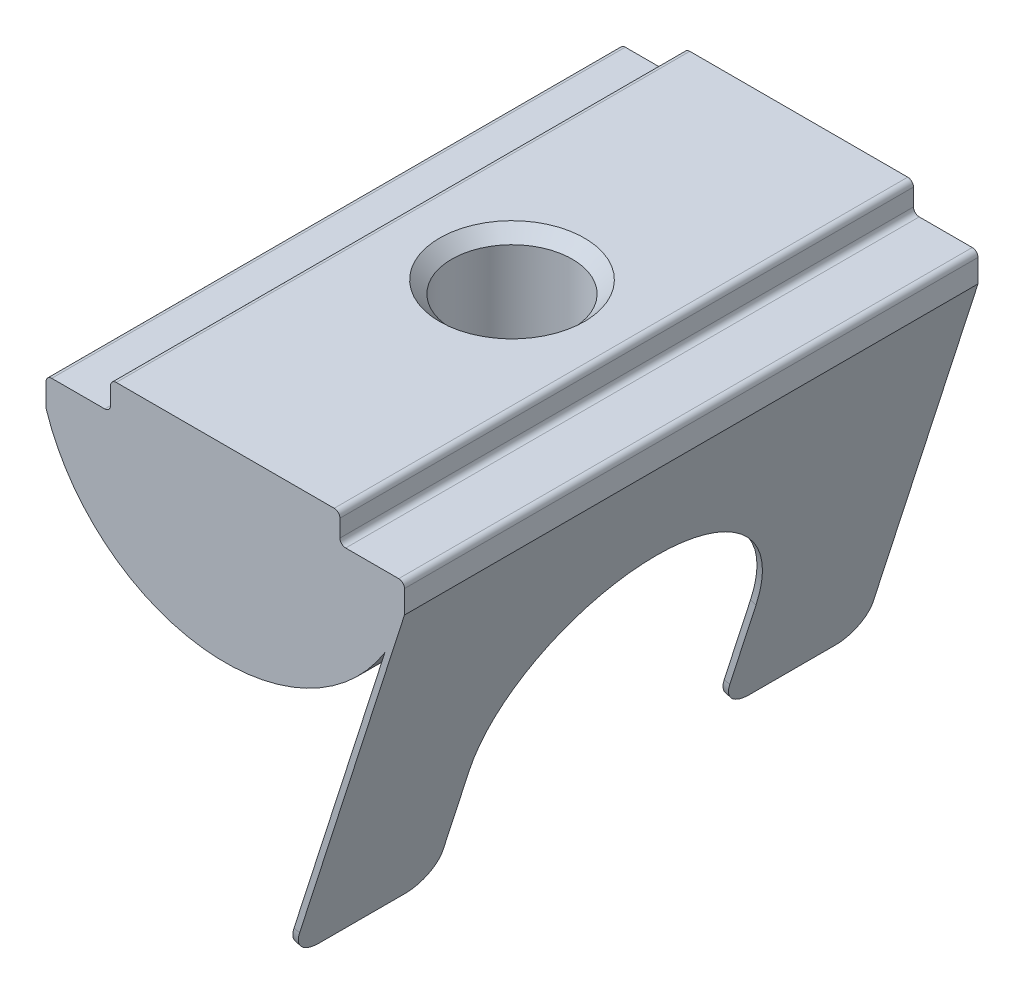
ISO-10303-21;
HEADER;
FILE_DESCRIPTION(('STEP AP214'),'2;1');
FILE_NAME('part.step','',(''),(''),'','','');
FILE_SCHEMA(('AUTOMOTIVE_DESIGN { 1 0 10303 214 1 1 1 1 }'));
ENDSEC;
DATA;
#1=APPLICATION_CONTEXT('core data for automotive mechanical design processes');
#2=APPLICATION_PROTOCOL_DEFINITION('international standard','automotive_design',2000,#1);
#3=PRODUCT_CONTEXT('',#1,'mechanical');
#4=PRODUCT('Part','Part','',(#3));
#5=PRODUCT_RELATED_PRODUCT_CATEGORY('part','',(#4));
#6=PRODUCT_DEFINITION_FORMATION('','',#4);
#7=PRODUCT_DEFINITION_CONTEXT('part definition',#1,'design');
#8=PRODUCT_DEFINITION('design','',#6,#7);
#9=PRODUCT_DEFINITION_SHAPE('','',#8);
#10=(LENGTH_UNIT() NAMED_UNIT(*) SI_UNIT(.MILLI.,.METRE.));
#11=(NAMED_UNIT(*) PLANE_ANGLE_UNIT() SI_UNIT($,.RADIAN.));
#12=(NAMED_UNIT(*) SI_UNIT($,.STERADIAN.) SOLID_ANGLE_UNIT());
#13=UNCERTAINTY_MEASURE_WITH_UNIT(LENGTH_MEASURE(1.E-05),#10,'distance_accuracy_value','');
#14=(GEOMETRIC_REPRESENTATION_CONTEXT(3) GLOBAL_UNCERTAINTY_ASSIGNED_CONTEXT((#13)) GLOBAL_UNIT_ASSIGNED_CONTEXT((#10,
#11,#12)) REPRESENTATION_CONTEXT('',''));
#15=CARTESIAN_POINT('',(0.,0.,0.));
#16=DIRECTION('',(0.,0.,1.));
#17=DIRECTION('',(1.,0.,0.));
#18=AXIS2_PLACEMENT_3D('',#15,#16,#17);
#19=CARTESIAN_POINT('',(2.09743071821094,-14.3205587681705,10.));
#20=DIRECTION('',(0.304775727103784,0.952424147199324,0.));
#21=DIRECTION('',(-0.952424147199324,0.304775727103784,0.));
#22=AXIS2_PLACEMENT_3D('',#19,#20,#21);
#23=PLANE('',#22);
#24=DIRECTION('',(0.,0.,-1.));
#25=VECTOR('',#24,1.);
#26=CARTESIAN_POINT('',(2.09743071821094,-14.3205587681705,10.));
#27=LINE('',#26,#25);
#28=CARTESIAN_POINT('',(2.09743071821094,-14.3205587681705,9.));
#29=VERTEX_POINT('',#28);
#30=CARTESIAN_POINT('',(2.09743071821094,-14.3205587681705,6.));
#31=VERTEX_POINT('',#30);
#32=EDGE_CURVE('E408',#29,#31,#27,.T.);
#33=ORIENTED_EDGE('',*,*,#32,.T.);
#34=DIRECTION('',(0.952424147199324,-0.304775727103784,0.));
#35=VECTOR('',#34,1.);
#36=CARTESIAN_POINT('',(2.09743071821094,-14.3205587681705,6.));
#37=LINE('',#36,#35);
#38=CARTESIAN_POINT('',(2.28791554765081,-14.3815139135912,6.));
#39=VERTEX_POINT('',#38);
#40=EDGE_CURVE('E364',#31,#39,#37,.T.);
#41=ORIENTED_EDGE('',*,*,#40,.T.);
#42=DIRECTION('',(0.,0.,-1.));
#43=VECTOR('',#42,1.);
#44=CARTESIAN_POINT('',(2.28791554765081,-14.3815139135912,10.));
#45=LINE('',#44,#43);
#46=CARTESIAN_POINT('',(2.28791554765081,-14.3815139135912,9.));
#47=VERTEX_POINT('',#46);
#48=EDGE_CURVE('E339',#47,#39,#45,.T.);
#49=ORIENTED_EDGE('',*,*,#48,.F.);
#50=DIRECTION('',(0.952424147199324,-0.304775727103784,0.));
#51=VECTOR('',#50,1.);
#52=CARTESIAN_POINT('',(2.09743071821094,-14.3205587681705,9.));
#53=LINE('',#52,#51);
#54=EDGE_CURVE('E362',#47,#29,#53,.F.);
#55=ORIENTED_EDGE('',*,*,#54,.T.);
#56=EDGE_LOOP('',(#33,#41,#49,#55));
#57=FACE_BOUND('',#56,.T.);
#58=ADVANCED_FACE('F37',(#57),#23,.F.);
#59=CARTESIAN_POINT('',(0.,0.,10.));
#60=DIRECTION('',(0.,0.,-1.));
#61=DIRECTION('',(-1.,0.,0.));
#62=AXIS2_PLACEMENT_3D('',#59,#60,#61);
#63=CYLINDRICAL_SURFACE('',#62,6.56220237420334);
#64=CARTESIAN_POINT('',(0.,-6.56220237420334,2.1));
#65=CARTESIAN_POINT('',(0.114837972898271,-6.56220209318466,2.09999968107459));
#66=CARTESIAN_POINT('',(0.229679907715986,-6.559159668174,2.0905492638789));
#67=CARTESIAN_POINT('',(0.455996684822379,-6.54732146200505,2.05310221910228));
#68=CARTESIAN_POINT('',(0.567470908819721,-6.53852463100784,2.02510220730504));
#69=CARTESIAN_POINT('',(0.783756369738062,-6.51613679070058,1.95160306994633));
#70=CARTESIAN_POINT('',(0.888577906794587,-6.5025534170512,1.90613180476144));
#71=CARTESIAN_POINT('',(1.08910806999092,-6.47198927944284,1.79910208523846));
#72=CARTESIAN_POINT('',(1.18481512390276,-6.45500793090185,1.73754086225176));
#73=CARTESIAN_POINT('',(1.36748363274895,-6.41883293542682,1.5979923591543));
#74=CARTESIAN_POINT('',(1.45411041189092,-6.39958936479068,1.5195799896454));
#75=CARTESIAN_POINT('',(1.61323560539941,-6.36134274912245,1.34945964265069));
#76=CARTESIAN_POINT('',(1.68573122484031,-6.3423397523657,1.25774904122205));
#77=CARTESIAN_POINT('',(1.81638455518048,-6.30618541130354,1.06069743562783));
#78=CARTESIAN_POINT('',(1.87411819163295,-6.28909541395882,0.955062922725573));
#79=CARTESIAN_POINT('',(1.9708605042522,-6.25945585062628,0.73494856654128));
#80=CARTESIAN_POINT('',(2.00987438699655,-6.24690502238607,0.620471193045037));
#81=CARTESIAN_POINT('',(2.06683414367046,-6.22828827837679,0.389708006852491));
#82=CARTESIAN_POINT('',(2.08540312035653,-6.2220311007487,0.273591865403767));
#83=CARTESIAN_POINT('',(2.10289310512259,-6.21614299045796,0.0397366080038057));
#84=CARTESIAN_POINT('',(2.10181963097214,-6.21651019693622,-0.0780020428814256));
#85=CARTESIAN_POINT('',(2.08054127152262,-6.22366096853996,-0.306550233554637));
#86=CARTESIAN_POINT('',(2.06113580162538,-6.23017641049133,-0.417444017446203));
#87=CARTESIAN_POINT('',(2.00504326158199,-6.24845283532842,-0.634310624484876));
#88=CARTESIAN_POINT('',(1.96835427307697,-6.26021440049221,-0.740282899941596));
#89=CARTESIAN_POINT('',(1.87818637351671,-6.28785816765236,-0.94617137388709));
#90=CARTESIAN_POINT('',(1.82446148993727,-6.30380010403038,-1.04597148433362));
#91=CARTESIAN_POINT('',(1.70191763500464,-6.33798182193432,-1.23539877738386));
#92=CARTESIAN_POINT('',(1.63309458422743,-6.35622222392232,-1.3250232006337));
#93=CARTESIAN_POINT('',(1.47841475218162,-6.39401394001684,-1.49606495477582));
#94=CARTESIAN_POINT('',(1.39190024886496,-6.41358620776773,-1.5768839895905));
#95=CARTESIAN_POINT('',(1.2063031519109,-6.45106843535328,-1.72301587074885));
#96=CARTESIAN_POINT('',(1.10721953538475,-6.46897825969075,-1.78832745383477));
#97=CARTESIAN_POINT('',(0.898102914882009,-6.50132175264522,-1.90202250078016));
#98=CARTESIAN_POINT('',(0.787983843891438,-6.51572451627568,-1.95025705304381));
#99=CARTESIAN_POINT('',(0.560625450045075,-6.53920761646083,-2.02733681502781));
#100=CARTESIAN_POINT('',(0.443388411968677,-6.54828965103952,-2.05618821099851));
#101=CARTESIAN_POINT('',(0.210195720792383,-6.55983189785325,-2.09264911263591));
#102=CARTESIAN_POINT('',(0.0943789242577967,-6.56254428644905,-2.10106802428145));
#103=CARTESIAN_POINT('',(-0.137028424222739,-6.5617911642366,-2.09871542507994));
#104=CARTESIAN_POINT('',(-0.252619008268713,-6.55832660492482,-2.08794686986862));
#105=CARTESIAN_POINT('',(-0.477129177611833,-6.54577488081022,-2.04817165516163));
#106=CARTESIAN_POINT('',(-0.586144253626822,-6.53683795064959,-2.01965198877257));
#107=CARTESIAN_POINT('',(-0.797807059643942,-6.51439489405104,-1.94578351867366));
#108=CARTESIAN_POINT('',(-0.900453990781565,-6.50088819571556,-1.90043260849766));
#109=CARTESIAN_POINT('',(-1.09933426769777,-6.47026647826994,-1.79292018579966));
#110=CARTESIAN_POINT('',(-1.19534199346514,-6.4530694071561,-1.7303653358489));
#111=CARTESIAN_POINT('',(-1.37576624761523,-6.41702781164892,-1.59068907754377));
#112=CARTESIAN_POINT('',(-1.46017947702196,-6.39818282085979,-1.5135635381653));
#113=CARTESIAN_POINT('',(-1.6186740570353,-6.35997820420135,-1.34312741143593));
#114=CARTESIAN_POINT('',(-1.6921781389746,-6.34062986575938,-1.24927622032743));
#115=CARTESIAN_POINT('',(-1.82245264394244,-6.30442333543144,-1.05015206944711));
#116=CARTESIAN_POINT('',(-1.87922320455711,-6.28756512307176,-0.944879203596157));
#117=CARTESIAN_POINT('',(-1.97409406049391,-6.25842810102044,-0.726032598276032));
#118=CARTESIAN_POINT('',(-2.01225572832212,-6.24613427036168,-0.612487584449459));
#119=CARTESIAN_POINT('',(-2.06876855501269,-6.22764786596621,-0.380105387986516));
#120=CARTESIAN_POINT('',(-2.08712773194925,-6.22145282290509,-0.261270367596047));
#121=CARTESIAN_POINT('',(-2.10292056714795,-6.21613118069138,-0.02774010056917));
#122=CARTESIAN_POINT('',(-2.10130508227452,-6.21668337636532,0.0868842899187375));
#123=CARTESIAN_POINT('',(-2.07950571781947,-6.22400876893457,0.314140714242524));
#124=CARTESIAN_POINT('',(-2.05932278527095,-6.23078164854373,0.426772849394802));
#125=CARTESIAN_POINT('',(-2.00161130676984,-6.2495554867399,0.645056165310856));
#126=CARTESIAN_POINT('',(-1.96436748873865,-6.26147044746646,0.750790587274424));
#127=CARTESIAN_POINT('',(-1.87381772625165,-6.28916038367176,0.9545933161729));
#128=CARTESIAN_POINT('',(-1.82050840343336,-6.30493617089981,1.05266000521716));
#129=CARTESIAN_POINT('',(-1.69680227954724,-6.3393720814804,1.24267135251031));
#130=CARTESIAN_POINT('',(-1.62579769197769,-6.35812354425033,1.33420369742646));
#131=CARTESIAN_POINT('',(-1.4697711032059,-6.39599162808321,1.50436175664481));
#132=CARTESIAN_POINT('',(-1.38474527902286,-6.41510834747541,1.58298393920731));
#133=CARTESIAN_POINT('',(-1.19952785842303,-6.45235223383863,1.72783895328859));
#134=CARTESIAN_POINT('',(-1.09891108213294,-6.47042171770385,1.79354468514162));
#135=CARTESIAN_POINT('',(-0.887484268081699,-6.5027904340613,1.90702736797981));
#136=CARTESIAN_POINT('',(-0.776677768697209,-6.51709096870059,1.95481051352097));
#137=CARTESIAN_POINT('',(-0.556075495231587,-6.53947189954991,2.02813317565881));
#138=CARTESIAN_POINT('',(-0.446758491661333,-6.54791953411465,2.05500262080888));
#139=CARTESIAN_POINT('',(-0.224961777297741,-6.55928428233315,2.09093417117999));
#140=CARTESIAN_POINT('',(-0.112482789187772,-6.56220264945869,2.10000031238464));
#141=CARTESIAN_POINT('',(0.,-6.56220237420334,2.1));
#142=B_SPLINE_CURVE_WITH_KNOTS('',3,(#64,#65,#66,#67,#68,#69,#70,#71,#72,#73,#74,#75,#76,#77,
#78,#79,#80,#81,#82,#83,#84,#85,#86,#87,#88,#89,#90,#91,#92,#93,#94,#95,#96,#97,#98,#99,#100,
#101,#102,#103,#104,#105,#106,#107,#108,#109,#110,#111,#112,#113,#114,#115,#116,#117,#118,#119,
#120,#121,#122,#123,#124,#125,#126,#127,#128,#129,#130,#131,#132,#133,#134,#135,#136,#137,#138,
#139,#140,#141),.UNSPECIFIED.,.T.,.F.,(4,2,2,2,2,2,2,2,2,2,2,2,2,2,2,2,2,2,2,2,2,2,2,2,2,2,2,2,
2,2,2,2,2,2,2,2,2,2,4),(0.,0.344100298309147,0.688263392095961,1.03187993189605,
1.37555563782444,1.72921148857121,2.08293721617852,2.44590436394302,2.80877050003487,
3.16024198833331,3.51161474613673,3.84833948455562,4.18510160605346,4.52696623529765,
4.8689233480996,5.22725086233284,5.58560755639724,5.94701631778454,6.30830967853666,
6.65503880919776,7.00171453435095,7.33927485484275,7.67687743598486,8.02295297867513,
8.3691267869789,8.729728948324,9.09032814464848,9.44972989591315,9.80898606988933,
10.1512090829284,10.4934146418425,10.8301062809461,11.1668687712966,11.5173542069483,
11.8679353632043,12.2307311801086,12.5934014886517,12.9305211520416,13.2675643820579),.UNSPECIFIED.);
#143=CARTESIAN_POINT('',(0.,-6.56220237420334,2.1));
#144=VERTEX_POINT('',#143);
#145=EDGE_CURVE('E273',#144,#144,#142,.T.);
#146=ORIENTED_EDGE('',*,*,#145,.T.);
#147=EDGE_LOOP('',(#146));
#148=FACE_BOUND('',#147,.T.);
#149=DIRECTION('',(0.,0.,-1.));
#150=VECTOR('',#149,1.);
#151=CARTESIAN_POINT('',(5.56951001555688,-3.47031096396441,10.));
#152=LINE('',#151,#150);
#153=CARTESIAN_POINT('',(5.56951001555688,-3.47031096396441,10.));
#154=VERTEX_POINT('',#153);
#155=CARTESIAN_POINT('',(5.56951001555688,-3.47031096396441,-10.));
#156=VERTEX_POINT('',#155);
#157=EDGE_CURVE('E410',#154,#156,#152,.T.);
#158=ORIENTED_EDGE('',*,*,#157,.F.);
#159=CARTESIAN_POINT('',(0.,0.,10.));
#160=DIRECTION('',(0.,0.,1.));
#161=DIRECTION('',(1.,0.,0.));
#162=AXIS2_PLACEMENT_3D('',#159,#160,#161);
#163=CIRCLE('',#162,6.56220237420334);
#164=CARTESIAN_POINT('',(-6.25,-2.,10.));
#165=VERTEX_POINT('',#164);
#166=EDGE_CURVE('E238',#165,#154,#163,.T.);
#167=ORIENTED_EDGE('',*,*,#166,.F.);
#168=DIRECTION('',(0.,0.,-1.));
#169=VECTOR('',#168,1.);
#170=CARTESIAN_POINT('',(-6.25,-2.,10.));
#171=LINE('',#170,#169);
#172=CARTESIAN_POINT('',(-6.25,-2.,-10.));
#173=VERTEX_POINT('',#172);
#174=EDGE_CURVE('E232',#165,#173,#171,.T.);
#175=ORIENTED_EDGE('',*,*,#174,.T.);
#176=CARTESIAN_POINT('',(0.,0.,-10.));
#177=DIRECTION('',(0.,0.,1.));
#178=DIRECTION('',(1.,0.,0.));
#179=AXIS2_PLACEMENT_3D('',#176,#177,#178);
#180=CIRCLE('',#179,6.56220237420334);
#181=EDGE_CURVE('E262',#173,#156,#180,.T.);
#182=ORIENTED_EDGE('',*,*,#181,.T.);
#183=EDGE_LOOP('',(#158,#167,#175,#182));
#184=FACE_BOUND('',#183,.T.);
#185=ADVANCED_FACE('F283',(#148,#184),#63,.T.);
#186=CARTESIAN_POINT('',(4.,-0.999999999999999,10.));
#187=DIRECTION('',(-1.,0.,0.));
#188=DIRECTION('',(0.,0.,1.));
#189=AXIS2_PLACEMENT_3D('',#186,#187,#188);
#190=PLANE('',#189);
#191=DIRECTION('',(0.,1.,0.));
#192=VECTOR('',#191,1.);
#193=CARTESIAN_POINT('',(4.,-0.999999999999999,10.));
#194=LINE('',#193,#192);
#195=CARTESIAN_POINT('',(4.,-0.799999999999998,10.));
#196=VERTEX_POINT('',#195);
#197=CARTESIAN_POINT('',(4.,-0.2,10.));
#198=VERTEX_POINT('',#197);
#199=EDGE_CURVE('E269',#196,#198,#194,.T.);
#200=ORIENTED_EDGE('',*,*,#199,.F.);
#201=DIRECTION('',(0.,0.,-1.));
#202=VECTOR('',#201,1.);
#203=CARTESIAN_POINT('',(4.,-0.799999999999998,-10.));
#204=LINE('',#203,#202);
#205=CARTESIAN_POINT('',(4.,-0.799999999999998,-10.));
#206=VERTEX_POINT('',#205);
#207=EDGE_CURVE('E488',#196,#206,#204,.T.);
#208=ORIENTED_EDGE('',*,*,#207,.T.);
#209=DIRECTION('',(0.,1.,0.));
#210=VECTOR('',#209,1.);
#211=CARTESIAN_POINT('',(4.,-0.999999999999999,-10.));
#212=LINE('',#211,#210);
#213=CARTESIAN_POINT('',(4.,-0.2,-10.));
#214=VERTEX_POINT('',#213);
#215=EDGE_CURVE('E247',#206,#214,#212,.T.);
#216=ORIENTED_EDGE('',*,*,#215,.T.);
#217=DIRECTION('',(0.,0.,-1.));
#218=VECTOR('',#217,1.);
#219=CARTESIAN_POINT('',(4.,-0.2,10.));
#220=LINE('',#219,#218);
#221=EDGE_CURVE('E491',#214,#198,#220,.F.);
#222=ORIENTED_EDGE('',*,*,#221,.T.);
#223=EDGE_LOOP('',(#200,#208,#216,#222));
#224=FACE_BOUND('',#223,.T.);
#225=ADVANCED_FACE('F318',(#224),#190,.F.);
#226=CARTESIAN_POINT('',(-4.,0.,10.));
#227=DIRECTION('',(0.,-1.,0.));
#228=DIRECTION('',(0.,0.,-1.));
#229=AXIS2_PLACEMENT_3D('',#226,#227,#228);
#230=PLANE('',#229);
#231=CARTESIAN_POINT('',(0.,0.,0.));
#232=DIRECTION('',(0.,1.,0.));
#233=DIRECTION('',(0.,0.,1.));
#234=AXIS2_PLACEMENT_3D('',#231,#232,#233);
#235=CIRCLE('',#234,2.525);
#236=CARTESIAN_POINT('',(0.,0.,2.525));
#237=VERTEX_POINT('',#236);
#238=EDGE_CURVE('E413',#237,#237,#235,.T.);
#239=ORIENTED_EDGE('',*,*,#238,.F.);
#240=EDGE_LOOP('',(#239));
#241=FACE_BOUND('',#240,.T.);
#242=DIRECTION('',(-1.,0.,0.));
#243=VECTOR('',#242,1.);
#244=CARTESIAN_POINT('',(-4.,0.,10.));
#245=LINE('',#244,#243);
#246=CARTESIAN_POINT('',(3.8,0.,10.));
#247=VERTEX_POINT('',#246);
#248=CARTESIAN_POINT('',(-3.8,0.,10.));
#249=VERTEX_POINT('',#248);
#250=EDGE_CURVE('E420',#247,#249,#245,.T.);
#251=ORIENTED_EDGE('',*,*,#250,.F.);
#252=DIRECTION('',(0.,0.,-1.));
#253=VECTOR('',#252,1.);
#254=CARTESIAN_POINT('',(3.8,0.,10.));
#255=LINE('',#254,#253);
#256=CARTESIAN_POINT('',(3.8,0.,-10.));
#257=VERTEX_POINT('',#256);
#258=EDGE_CURVE('E483',#247,#257,#255,.T.);
#259=ORIENTED_EDGE('',*,*,#258,.T.);
#260=DIRECTION('',(-1.,0.,0.));
#261=VECTOR('',#260,1.);
#262=CARTESIAN_POINT('',(-4.,0.,-10.));
#263=LINE('',#262,#261);
#264=CARTESIAN_POINT('',(-3.8,0.,-10.));
#265=VERTEX_POINT('',#264);
#266=EDGE_CURVE('E250',#257,#265,#263,.T.);
#267=ORIENTED_EDGE('',*,*,#266,.T.);
#268=DIRECTION('',(0.,0.,-1.));
#269=VECTOR('',#268,1.);
#270=CARTESIAN_POINT('',(-3.8,0.,10.));
#271=LINE('',#270,#269);
#272=EDGE_CURVE('E486',#265,#249,#271,.F.);
#273=ORIENTED_EDGE('',*,*,#272,.T.);
#274=EDGE_LOOP('',(#251,#259,#267,#273));
#275=FACE_BOUND('',#274,.T.);
#276=ADVANCED_FACE('F529',(#241,#275),#230,.F.);
#277=CARTESIAN_POINT('',(-4.,0.,10.));
#278=DIRECTION('',(1.,0.,0.));
#279=DIRECTION('',(0.,0.,-1.));
#280=AXIS2_PLACEMENT_3D('',#277,#278,#279);
#281=PLANE('',#280);
#282=DIRECTION('',(0.,-1.,0.));
#283=VECTOR('',#282,1.);
#284=CARTESIAN_POINT('',(-4.,0.,-10.));
#285=LINE('',#284,#283);
#286=CARTESIAN_POINT('',(-4.,-0.2,-10.));
#287=VERTEX_POINT('',#286);
#288=CARTESIAN_POINT('',(-4.,-0.8,-10.));
#289=VERTEX_POINT('',#288);
#290=EDGE_CURVE('E254',#287,#289,#285,.T.);
#291=ORIENTED_EDGE('',*,*,#290,.T.);
#292=DIRECTION('',(0.,0.,-1.));
#293=VECTOR('',#292,1.);
#294=CARTESIAN_POINT('',(-4.,-0.8,10.));
#295=LINE('',#294,#293);
#296=CARTESIAN_POINT('',(-4.,-0.8,10.));
#297=VERTEX_POINT('',#296);
#298=EDGE_CURVE('E471',#289,#297,#295,.F.);
#299=ORIENTED_EDGE('',*,*,#298,.T.);
#300=DIRECTION('',(0.,-1.,0.));
#301=VECTOR('',#300,1.);
#302=CARTESIAN_POINT('',(-4.,0.,10.));
#303=LINE('',#302,#301);
#304=CARTESIAN_POINT('',(-4.,-0.2,10.));
#305=VERTEX_POINT('',#304);
#306=EDGE_CURVE('E423',#305,#297,#303,.T.);
#307=ORIENTED_EDGE('',*,*,#306,.F.);
#308=DIRECTION('',(0.,0.,-1.));
#309=VECTOR('',#308,1.);
#310=CARTESIAN_POINT('',(-4.,-0.2,10.));
#311=LINE('',#310,#309);
#312=EDGE_CURVE('E473',#305,#287,#311,.T.);
#313=ORIENTED_EDGE('',*,*,#312,.T.);
#314=EDGE_LOOP('',(#291,#299,#307,#313));
#315=FACE_BOUND('',#314,.T.);
#316=ADVANCED_FACE('F538',(#315),#281,.F.);
#317=CARTESIAN_POINT('',(-4.,-1.,10.));
#318=DIRECTION('',(0.,-1.,0.));
#319=DIRECTION('',(1.,0.,0.));
#320=AXIS2_PLACEMENT_3D('',#317,#318,#319);
#321=PLANE('',#320);
#322=DIRECTION('',(-1.,0.,0.));
#323=VECTOR('',#322,1.);
#324=CARTESIAN_POINT('',(-4.,-1.,-10.));
#325=LINE('',#324,#323);
#326=CARTESIAN_POINT('',(-4.2,-1.,-10.));
#327=VERTEX_POINT('',#326);
#328=CARTESIAN_POINT('',(-6.05,-1.,-10.));
#329=VERTEX_POINT('',#328);
#330=EDGE_CURVE('E257',#327,#329,#325,.T.);
#331=ORIENTED_EDGE('',*,*,#330,.T.);
#332=DIRECTION('',(0.,0.,-1.));
#333=VECTOR('',#332,1.);
#334=CARTESIAN_POINT('',(-6.05,-1.,10.));
#335=LINE('',#334,#333);
#336=CARTESIAN_POINT('',(-6.05,-1.,10.));
#337=VERTEX_POINT('',#336);
#338=EDGE_CURVE('E476',#329,#337,#335,.F.);
#339=ORIENTED_EDGE('',*,*,#338,.T.);
#340=DIRECTION('',(-1.,0.,0.));
#341=VECTOR('',#340,1.);
#342=CARTESIAN_POINT('',(-4.,-1.,10.));
#343=LINE('',#342,#341);
#344=CARTESIAN_POINT('',(-4.2,-1.,10.));
#345=VERTEX_POINT('',#344);
#346=EDGE_CURVE('E426',#345,#337,#343,.T.);
#347=ORIENTED_EDGE('',*,*,#346,.F.);
#348=DIRECTION('',(0.,0.,-1.));
#349=VECTOR('',#348,1.);
#350=CARTESIAN_POINT('',(-4.2,-1.,-10.));
#351=LINE('',#350,#349);
#352=EDGE_CURVE('E478',#345,#327,#351,.T.);
#353=ORIENTED_EDGE('',*,*,#352,.T.);
#354=EDGE_LOOP('',(#331,#339,#347,#353));
#355=FACE_BOUND('',#354,.T.);
#356=ADVANCED_FACE('F309',(#355),#321,.F.);
#357=CARTESIAN_POINT('',(-6.25,-1.,10.));
#358=DIRECTION('',(1.,0.,0.));
#359=DIRECTION('',(0.,1.,0.));
#360=AXIS2_PLACEMENT_3D('',#357,#358,#359);
#361=PLANE('',#360);
#362=DIRECTION('',(0.,-1.,0.));
#363=VECTOR('',#362,1.);
#364=CARTESIAN_POINT('',(-6.25,-1.,10.));
#365=LINE('',#364,#363);
#366=CARTESIAN_POINT('',(-6.25,-1.2,10.));
#367=VERTEX_POINT('',#366);
#368=EDGE_CURVE('E243',#367,#165,#365,.T.);
#369=ORIENTED_EDGE('',*,*,#368,.F.);
#370=DIRECTION('',(0.,0.,-1.));
#371=VECTOR('',#370,1.);
#372=CARTESIAN_POINT('',(-6.25,-1.2,10.));
#373=LINE('',#372,#371);
#374=CARTESIAN_POINT('',(-6.25,-1.2,-10.));
#375=VERTEX_POINT('',#374);
#376=EDGE_CURVE('E481',#367,#375,#373,.T.);
#377=ORIENTED_EDGE('',*,*,#376,.T.);
#378=DIRECTION('',(0.,-1.,0.));
#379=VECTOR('',#378,1.);
#380=CARTESIAN_POINT('',(-6.25,-1.,-10.));
#381=LINE('',#380,#379);
#382=EDGE_CURVE('E260',#375,#173,#381,.T.);
#383=ORIENTED_EDGE('',*,*,#382,.T.);
#384=ORIENTED_EDGE('',*,*,#174,.F.);
#385=EDGE_LOOP('',(#369,#377,#383,#384));
#386=FACE_BOUND('',#385,.T.);
#387=ADVANCED_FACE('F305',(#386),#361,.F.);
#388=CARTESIAN_POINT('',(6.25,-0.999999999999999,10.));
#389=DIRECTION('',(-1.,0.,0.));
#390=DIRECTION('',(0.,0.,1.));
#391=AXIS2_PLACEMENT_3D('',#388,#389,#390);
#392=PLANE('',#391);
#393=DIRECTION('',(0.,1.,0.));
#394=VECTOR('',#393,1.);
#395=CARTESIAN_POINT('',(6.25,-0.999999999999999,-10.));
#396=LINE('',#395,#394);
#397=CARTESIAN_POINT('',(6.25,-2.,-10.));
#398=VERTEX_POINT('',#397);
#399=CARTESIAN_POINT('',(6.25,-1.2,-10.));
#400=VERTEX_POINT('',#399);
#401=EDGE_CURVE('E265',#398,#400,#396,.T.);
#402=ORIENTED_EDGE('',*,*,#401,.T.);
#403=DIRECTION('',(0.,0.,-1.));
#404=VECTOR('',#403,1.);
#405=CARTESIAN_POINT('',(6.25,-1.2,10.));
#406=LINE('',#405,#404);
#407=CARTESIAN_POINT('',(6.25,-1.2,10.));
#408=VERTEX_POINT('',#407);
#409=EDGE_CURVE('E237',#400,#408,#406,.F.);
#410=ORIENTED_EDGE('',*,*,#409,.T.);
#411=DIRECTION('',(0.,1.,0.));
#412=VECTOR('',#411,1.);
#413=CARTESIAN_POINT('',(6.25,-0.999999999999999,10.));
#414=LINE('',#413,#412);
#415=CARTESIAN_POINT('',(6.25,-2.,10.));
#416=VERTEX_POINT('',#415);
#417=EDGE_CURVE('E216',#416,#408,#414,.T.);
#418=ORIENTED_EDGE('',*,*,#417,.F.);
#419=DIRECTION('',(0.,0.,-1.));
#420=VECTOR('',#419,1.);
#421=CARTESIAN_POINT('',(6.25,-2.,10.));
#422=LINE('',#421,#420);
#423=EDGE_CURVE('E224',#416,#398,#422,.T.);
#424=ORIENTED_EDGE('',*,*,#423,.T.);
#425=EDGE_LOOP('',(#402,#410,#418,#424));
#426=FACE_BOUND('',#425,.T.);
#427=ADVANCED_FACE('F235',(#426),#392,.F.);
#428=CARTESIAN_POINT('',(4.,-0.999999999999999,10.));
#429=DIRECTION('',(0.,-1.,0.));
#430=DIRECTION('',(1.,0.,0.));
#431=AXIS2_PLACEMENT_3D('',#428,#429,#430);
#432=PLANE('',#431);
#433=DIRECTION('',(-1.,0.,0.));
#434=VECTOR('',#433,1.);
#435=CARTESIAN_POINT('',(4.,-0.999999999999999,10.));
#436=LINE('',#435,#434);
#437=CARTESIAN_POINT('',(6.05,-0.999999999999999,10.));
#438=VERTEX_POINT('',#437);
#439=CARTESIAN_POINT('',(4.2,-0.999999999999999,10.));
#440=VERTEX_POINT('',#439);
#441=EDGE_CURVE('E233',#438,#440,#436,.T.);
#442=ORIENTED_EDGE('',*,*,#441,.F.);
#443=DIRECTION('',(0.,0.,-1.));
#444=VECTOR('',#443,1.);
#445=CARTESIAN_POINT('',(6.05,-0.999999999999999,10.));
#446=LINE('',#445,#444);
#447=CARTESIAN_POINT('',(6.05,-0.999999999999999,-10.));
#448=VERTEX_POINT('',#447);
#449=EDGE_CURVE('E508',#438,#448,#446,.T.);
#450=ORIENTED_EDGE('',*,*,#449,.T.);
#451=DIRECTION('',(-1.,0.,0.));
#452=VECTOR('',#451,1.);
#453=CARTESIAN_POINT('',(4.,-0.999999999999999,-10.));
#454=LINE('',#453,#452);
#455=CARTESIAN_POINT('',(4.2,-0.999999999999999,-10.));
#456=VERTEX_POINT('',#455);
#457=EDGE_CURVE('E267',#448,#456,#454,.T.);
#458=ORIENTED_EDGE('',*,*,#457,.T.);
#459=DIRECTION('',(0.,0.,-1.));
#460=VECTOR('',#459,1.);
#461=CARTESIAN_POINT('',(4.2,-0.999999999999999,10.));
#462=LINE('',#461,#460);
#463=EDGE_CURVE('E281',#456,#440,#462,.F.);
#464=ORIENTED_EDGE('',*,*,#463,.T.);
#465=EDGE_LOOP('',(#442,#450,#458,#464));
#466=FACE_BOUND('',#465,.T.);
#467=ADVANCED_FACE('F298',(#466),#432,.F.);
#468=CARTESIAN_POINT('',(0.,0.,10.));
#469=DIRECTION('',(0.,0.,1.));
#470=DIRECTION('',(1.,0.,0.));
#471=AXIS2_PLACEMENT_3D('',#468,#469,#470);
#472=PLANE('',#471);
#473=DIRECTION('',(-0.304775727103784,-0.952424147199324,0.));
#474=VECTOR('',#473,1.);
#475=CARTESIAN_POINT('',(6.05951517056013,-1.93904485457925,10.));
#476=LINE('',#475,#474);
#477=CARTESIAN_POINT('',(2.40220644531473,-13.3681346209711,10.));
#478=VERTEX_POINT('',#477);
#479=EDGE_CURVE('E221',#154,#478,#476,.T.);
#480=ORIENTED_EDGE('',*,*,#479,.T.);
#481=DIRECTION('',(0.952424147199324,-0.304775727103784,0.));
#482=VECTOR('',#481,1.);
#483=CARTESIAN_POINT('',(2.59269127475459,-13.4290897663919,10.));
#484=LINE('',#483,#482);
#485=CARTESIAN_POINT('',(2.59269127475459,-13.4290897663919,10.));
#486=VERTEX_POINT('',#485);
#487=EDGE_CURVE('E219',#478,#486,#484,.T.);
#488=ORIENTED_EDGE('',*,*,#487,.T.);
#489=DIRECTION('',(0.304775727103784,0.952424147199324,0.));
#490=VECTOR('',#489,1.);
#491=CARTESIAN_POINT('',(6.25,-2.,10.));
#492=LINE('',#491,#490);
#493=EDGE_CURVE('E211',#486,#416,#492,.T.);
#494=ORIENTED_EDGE('',*,*,#493,.T.);
#495=ORIENTED_EDGE('',*,*,#417,.T.);
#496=CARTESIAN_POINT('',(6.05,-1.2,10.));
#497=DIRECTION('',(0.,0.,1.));
#498=DIRECTION('',(1.,0.,0.));
#499=AXIS2_PLACEMENT_3D('',#496,#497,#498);
#500=CIRCLE('',#499,0.2);
#501=EDGE_CURVE('E493',#408,#438,#500,.T.);
#502=ORIENTED_EDGE('',*,*,#501,.T.);
#503=ORIENTED_EDGE('',*,*,#441,.T.);
#504=CARTESIAN_POINT('',(4.2,-0.799999999999998,10.));
#505=DIRECTION('',(0.,0.,1.));
#506=DIRECTION('',(1.,0.,0.));
#507=AXIS2_PLACEMENT_3D('',#504,#505,#506);
#508=CIRCLE('',#507,0.2);
#509=EDGE_CURVE('E467',#440,#196,#508,.F.);
#510=ORIENTED_EDGE('',*,*,#509,.T.);
#511=ORIENTED_EDGE('',*,*,#199,.T.);
#512=CARTESIAN_POINT('',(3.8,-0.2,10.));
#513=DIRECTION('',(0.,0.,1.));
#514=DIRECTION('',(1.,0.,0.));
#515=AXIS2_PLACEMENT_3D('',#512,#513,#514);
#516=CIRCLE('',#515,0.2);
#517=EDGE_CURVE('E495',#198,#247,#516,.T.);
#518=ORIENTED_EDGE('',*,*,#517,.T.);
#519=ORIENTED_EDGE('',*,*,#250,.T.);
#520=CARTESIAN_POINT('',(-3.8,-0.2,10.));
#521=DIRECTION('',(0.,0.,1.));
#522=DIRECTION('',(1.,0.,0.));
#523=AXIS2_PLACEMENT_3D('',#520,#521,#522);
#524=CIRCLE('',#523,0.2);
#525=EDGE_CURVE('E498',#249,#305,#524,.T.);
#526=ORIENTED_EDGE('',*,*,#525,.T.);
#527=ORIENTED_EDGE('',*,*,#306,.T.);
#528=CARTESIAN_POINT('',(-4.2,-0.8,10.));
#529=DIRECTION('',(0.,0.,1.));
#530=DIRECTION('',(1.,0.,0.));
#531=AXIS2_PLACEMENT_3D('',#528,#529,#530);
#532=CIRCLE('',#531,0.2);
#533=EDGE_CURVE('E463',#297,#345,#532,.F.);
#534=ORIENTED_EDGE('',*,*,#533,.T.);
#535=ORIENTED_EDGE('',*,*,#346,.T.);
#536=CARTESIAN_POINT('',(-6.05,-1.2,10.));
#537=DIRECTION('',(0.,0.,1.));
#538=DIRECTION('',(1.,0.,0.));
#539=AXIS2_PLACEMENT_3D('',#536,#537,#538);
#540=CIRCLE('',#539,0.2);
#541=EDGE_CURVE('E432',#337,#367,#540,.T.);
#542=ORIENTED_EDGE('',*,*,#541,.T.);
#543=ORIENTED_EDGE('',*,*,#368,.T.);
#544=ORIENTED_EDGE('',*,*,#166,.T.);
#545=EDGE_LOOP('',(#480,#488,#494,#495,#502,#503,#510,#511,#518,#519,#526,#527,#534,#535,#542,
#543,#544));
#546=FACE_BOUND('',#545,.T.);
#547=ADVANCED_FACE('F214',(#546),#472,.T.);
#548=CARTESIAN_POINT('',(0.,0.,-10.));
#549=DIRECTION('',(0.,0.,1.));
#550=DIRECTION('',(1.,0.,0.));
#551=AXIS2_PLACEMENT_3D('',#548,#549,#550);
#552=PLANE('',#551);
#553=DIRECTION('',(0.304775727103784,0.952424147199324,0.));
#554=VECTOR('',#553,1.);
#555=CARTESIAN_POINT('',(6.25,-2.,-10.));
#556=LINE('',#555,#554);
#557=CARTESIAN_POINT('',(2.59269127475459,-13.4290897663919,-10.));
#558=VERTEX_POINT('',#557);
#559=EDGE_CURVE('E228',#558,#398,#556,.T.);
#560=ORIENTED_EDGE('',*,*,#559,.F.);
#561=DIRECTION('',(0.952424147199324,-0.304775727103784,0.));
#562=VECTOR('',#561,1.);
#563=CARTESIAN_POINT('',(-3.65730872524541,-11.4290897663919,-10.));
#564=LINE('',#563,#562);
#565=CARTESIAN_POINT('',(2.40220644531473,-13.3681346209711,-10.));
#566=VERTEX_POINT('',#565);
#567=EDGE_CURVE('E360',#558,#566,#564,.F.);
#568=ORIENTED_EDGE('',*,*,#567,.T.);
#569=DIRECTION('',(-0.304775727103784,-0.952424147199324,0.));
#570=VECTOR('',#569,1.);
#571=CARTESIAN_POINT('',(6.05951517056013,-1.93904485457925,-10.));
#572=LINE('',#571,#570);
#573=EDGE_CURVE('E386',#156,#566,#572,.T.);
#574=ORIENTED_EDGE('',*,*,#573,.F.);
#575=ORIENTED_EDGE('',*,*,#181,.F.);
#576=ORIENTED_EDGE('',*,*,#382,.F.);
#577=CARTESIAN_POINT('',(-6.05,-1.2,-10.));
#578=DIRECTION('',(0.,0.,1.));
#579=DIRECTION('',(1.,0.,0.));
#580=AXIS2_PLACEMENT_3D('',#577,#578,#579);
#581=CIRCLE('',#580,0.2);
#582=EDGE_CURVE('E505',#375,#329,#581,.F.);
#583=ORIENTED_EDGE('',*,*,#582,.T.);
#584=ORIENTED_EDGE('',*,*,#330,.F.);
#585=CARTESIAN_POINT('',(-4.2,-0.8,-10.));
#586=DIRECTION('',(0.,0.,1.));
#587=DIRECTION('',(1.,0.,0.));
#588=AXIS2_PLACEMENT_3D('',#585,#586,#587);
#589=CIRCLE('',#588,0.2);
#590=EDGE_CURVE('E465',#327,#289,#589,.T.);
#591=ORIENTED_EDGE('',*,*,#590,.T.);
#592=ORIENTED_EDGE('',*,*,#290,.F.);
#593=CARTESIAN_POINT('',(-3.8,-0.2,-10.));
#594=DIRECTION('',(0.,0.,1.));
#595=DIRECTION('',(1.,0.,0.));
#596=AXIS2_PLACEMENT_3D('',#593,#594,#595);
#597=CIRCLE('',#596,0.2);
#598=EDGE_CURVE('E507',#287,#265,#597,.F.);
#599=ORIENTED_EDGE('',*,*,#598,.T.);
#600=ORIENTED_EDGE('',*,*,#266,.F.);
#601=CARTESIAN_POINT('',(3.8,-0.2,-10.));
#602=DIRECTION('',(0.,0.,1.));
#603=DIRECTION('',(1.,0.,0.));
#604=AXIS2_PLACEMENT_3D('',#601,#602,#603);
#605=CIRCLE('',#604,0.2);
#606=EDGE_CURVE('E503',#257,#214,#605,.F.);
#607=ORIENTED_EDGE('',*,*,#606,.T.);
#608=ORIENTED_EDGE('',*,*,#215,.F.);
#609=CARTESIAN_POINT('',(4.2,-0.799999999999998,-10.));
#610=DIRECTION('',(0.,0.,1.));
#611=DIRECTION('',(1.,0.,0.));
#612=AXIS2_PLACEMENT_3D('',#609,#610,#611);
#613=CIRCLE('',#612,0.2);
#614=EDGE_CURVE('E469',#206,#456,#613,.T.);
#615=ORIENTED_EDGE('',*,*,#614,.T.);
#616=ORIENTED_EDGE('',*,*,#457,.F.);
#617=CARTESIAN_POINT('',(6.05,-1.2,-10.));
#618=DIRECTION('',(0.,0.,1.));
#619=DIRECTION('',(1.,0.,0.));
#620=AXIS2_PLACEMENT_3D('',#617,#618,#619);
#621=CIRCLE('',#620,0.2);
#622=EDGE_CURVE('E501',#448,#400,#621,.F.);
#623=ORIENTED_EDGE('',*,*,#622,.T.);
#624=ORIENTED_EDGE('',*,*,#401,.F.);
#625=EDGE_LOOP('',(#560,#568,#574,#575,#576,#583,#584,#591,#592,#599,#600,#607,#608,#615,#616,
#623,#624));
#626=FACE_BOUND('',#625,.T.);
#627=ADVANCED_FACE('F293',(#626),#552,.F.);
#628=CARTESIAN_POINT('',(0.,0.,0.));
#629=DIRECTION('',(0.,1.,0.));
#630=DIRECTION('',(0.,0.,1.));
#631=AXIS2_PLACEMENT_3D('',#628,#629,#630);
#632=CYLINDRICAL_SURFACE('',#631,2.1);
#633=CARTESIAN_POINT('',(0.,-0.424999999999998,0.));
#634=DIRECTION('',(0.,1.,0.));
#635=DIRECTION('',(0.,0.,1.));
#636=AXIS2_PLACEMENT_3D('',#633,#634,#635);
#637=CIRCLE('',#636,2.1);
#638=CARTESIAN_POINT('',(0.,-0.424999999999998,2.1));
#639=VERTEX_POINT('',#638);
#640=EDGE_CURVE('E251',#639,#639,#637,.T.);
#641=ORIENTED_EDGE('',*,*,#640,.T.);
#642=EDGE_LOOP('',(#641));
#643=FACE_BOUND('',#642,.T.);
#644=ORIENTED_EDGE('',*,*,#145,.F.);
#645=EDGE_LOOP('',(#644));
#646=FACE_BOUND('',#645,.T.);
#647=ADVANCED_FACE('F287',(#643,#646),#632,.F.);
#648=CARTESIAN_POINT('',(0.,0.,0.));
#649=DIRECTION('',(0.,1.,0.));
#650=DIRECTION('',(0.,0.,1.));
#651=AXIS2_PLACEMENT_3D('',#648,#649,#650);
#652=CONICAL_SURFACE('',#651,2.525,0.78539816339745);
#653=ORIENTED_EDGE('',*,*,#640,.F.);
#654=EDGE_LOOP('',(#653));
#655=FACE_BOUND('',#654,.T.);
#656=ORIENTED_EDGE('',*,*,#238,.T.);
#657=EDGE_LOOP('',(#656));
#658=FACE_BOUND('',#657,.T.);
#659=ADVANCED_FACE('F292',(#655,#658),#652,.F.);
#660=CARTESIAN_POINT('',(6.05951517056013,-1.93904485457925,10.));
#661=DIRECTION('',(0.952424147199324,-0.304775727103784,0.));
#662=DIRECTION('',(0.304775727103784,0.952424147199324,0.));
#663=AXIS2_PLACEMENT_3D('',#660,#661,#662);
#664=PLANE('',#663);
#665=CARTESIAN_POINT('',(2.09743071821094,-14.3205587681705,-6.));
#666=VERTEX_POINT('',#665);
#667=CARTESIAN_POINT('',(2.09743071821094,-14.3205587681705,-9.));
#668=VERTEX_POINT('',#667);
#669=EDGE_CURVE('E411',#666,#668,#27,.T.);
#670=ORIENTED_EDGE('',*,*,#669,.F.);
#671=CARTESIAN_POINT('',(2.40220644531473,-13.3681346209711,-6.));
#672=DIRECTION('',(0.952424147199324,-0.304775727103784,0.));
#673=DIRECTION('',(0.304775727103784,0.952424147199324,0.));
#674=AXIS2_PLACEMENT_3D('',#671,#672,#673);
#675=CIRCLE('',#674,1.);
#676=CARTESIAN_POINT('',(2.40220644531473,-13.3681346209711,-5.));
#677=VERTEX_POINT('',#676);
#678=EDGE_CURVE('E348',#666,#677,#675,.F.);
#679=ORIENTED_EDGE('',*,*,#678,.T.);
#680=DIRECTION('',(-0.304775727103784,-0.952424147199324,0.));
#681=VECTOR('',#680,1.);
#682=CARTESIAN_POINT('',(2.09743071821094,-14.3205587681705,-5.));
#683=LINE('',#682,#681);
#684=CARTESIAN_POINT('',(3.31653362662608,-10.5108621793732,-5.));
#685=VERTEX_POINT('',#684);
#686=EDGE_CURVE('E391',#685,#677,#683,.T.);
#687=ORIENTED_EDGE('',*,*,#686,.F.);
#688=CARTESIAN_POINT('',(3.31653362662607,-10.5108621793732,0.));
#689=DIRECTION('',(0.952424147199324,-0.304775727103784,0.));
#690=DIRECTION('',(0.304775727103784,0.952424147199324,0.));
#691=AXIS2_PLACEMENT_3D('',#688,#689,#690);
#692=CIRCLE('',#691,5.);
#693=CARTESIAN_POINT('',(4.840412262145,-5.74874144337654,0.));
#694=VERTEX_POINT('',#693);
#695=EDGE_CURVE('E11',#685,#694,#692,.T.);
#696=ORIENTED_EDGE('',*,*,#695,.T.);
#697=CARTESIAN_POINT('',(3.31653362662608,-10.5108621793732,0.));
#698=DIRECTION('',(0.952424147199324,-0.304775727103784,0.));
#699=DIRECTION('',(0.304775727103784,0.952424147199324,0.));
#700=AXIS2_PLACEMENT_3D('',#697,#698,#699);
#701=CIRCLE('',#700,5.);
#702=CARTESIAN_POINT('',(3.31653362662608,-10.5108621793732,5.));
#703=VERTEX_POINT('',#702);
#704=EDGE_CURVE('E376',#694,#703,#701,.T.);
#705=ORIENTED_EDGE('',*,*,#704,.T.);
#706=DIRECTION('',(0.304775727103784,0.952424147199324,0.));
#707=VECTOR('',#706,1.);
#708=CARTESIAN_POINT('',(2.09743071821094,-14.3205587681705,5.));
#709=LINE('',#708,#707);
#710=CARTESIAN_POINT('',(2.40220644531473,-13.3681346209711,5.));
#711=VERTEX_POINT('',#710);
#712=EDGE_CURVE('E396',#711,#703,#709,.T.);
#713=ORIENTED_EDGE('',*,*,#712,.F.);
#714=CARTESIAN_POINT('',(2.40220644531473,-13.3681346209711,6.));
#715=DIRECTION('',(0.952424147199324,-0.304775727103784,0.));
#716=DIRECTION('',(0.304775727103784,0.952424147199324,0.));
#717=AXIS2_PLACEMENT_3D('',#714,#715,#716);
#718=CIRCLE('',#717,1.);
#719=EDGE_CURVE('E351',#711,#31,#718,.F.);
#720=ORIENTED_EDGE('',*,*,#719,.T.);
#721=ORIENTED_EDGE('',*,*,#32,.F.);
#722=CARTESIAN_POINT('',(2.40220644531472,-13.3681346209711,9.));
#723=DIRECTION('',(0.952424147199324,-0.304775727103784,0.));
#724=DIRECTION('',(0.304775727103784,0.952424147199324,0.));
#725=AXIS2_PLACEMENT_3D('',#722,#723,#724);
#726=CIRCLE('',#725,1.);
#727=EDGE_CURVE('E349',#29,#478,#726,.F.);
#728=ORIENTED_EDGE('',*,*,#727,.T.);
#729=ORIENTED_EDGE('',*,*,#479,.F.);
#730=ORIENTED_EDGE('',*,*,#157,.T.);
#731=ORIENTED_EDGE('',*,*,#573,.T.);
#732=CARTESIAN_POINT('',(2.40220644531473,-13.3681346209711,-9.));
#733=DIRECTION('',(0.952424147199324,-0.304775727103784,0.));
#734=DIRECTION('',(0.304775727103784,0.952424147199324,0.));
#735=AXIS2_PLACEMENT_3D('',#732,#733,#734);
#736=CIRCLE('',#735,1.);
#737=EDGE_CURVE('E357',#566,#668,#736,.F.);
#738=ORIENTED_EDGE('',*,*,#737,.T.);
#739=EDGE_LOOP('',(#670,#679,#687,#696,#705,#713,#720,#721,#728,#729,#730,#731,#738));
#740=FACE_BOUND('',#739,.T.);
#741=ADVANCED_FACE('F323',(#740),#664,.F.);
#742=CARTESIAN_POINT('',(2.28791554765081,-14.3815139135912,-6.));
#743=VERTEX_POINT('',#742);
#744=CARTESIAN_POINT('',(2.28791554765081,-14.3815139135912,-9.));
#745=VERTEX_POINT('',#744);
#746=EDGE_CURVE('E220',#743,#745,#45,.T.);
#747=ORIENTED_EDGE('',*,*,#746,.F.);
#748=DIRECTION('',(0.952424147199324,-0.304775727103784,0.));
#749=VECTOR('',#748,1.);
#750=CARTESIAN_POINT('',(2.09743071821094,-14.3205587681705,-6.));
#751=LINE('',#750,#749);
#752=EDGE_CURVE('E335',#743,#666,#751,.F.);
#753=ORIENTED_EDGE('',*,*,#752,.T.);
#754=ORIENTED_EDGE('',*,*,#669,.T.);
#755=DIRECTION('',(0.952424147199324,-0.304775727103784,0.));
#756=VECTOR('',#755,1.);
#757=CARTESIAN_POINT('',(2.09743071821094,-14.3205587681705,-9.));
#758=LINE('',#757,#756);
#759=EDGE_CURVE('E338',#668,#745,#758,.T.);
#760=ORIENTED_EDGE('',*,*,#759,.T.);
#761=EDGE_LOOP('',(#747,#753,#754,#760));
#762=FACE_BOUND('',#761,.T.);
#763=ADVANCED_FACE('F314',(#762),#23,.F.);
#764=CARTESIAN_POINT('',(6.25,-2.,10.));
#765=DIRECTION('',(-0.952424147199324,0.304775727103784,0.));
#766=DIRECTION('',(-0.304775727103784,-0.952424147199324,0.));
#767=AXIS2_PLACEMENT_3D('',#764,#765,#766);
#768=PLANE('',#767);
#769=DIRECTION('',(0.304775727103784,0.952424147199324,0.));
#770=VECTOR('',#769,1.);
#771=CARTESIAN_POINT('',(2.28791554765081,-14.3815139135912,-5.));
#772=LINE('',#771,#770);
#773=CARTESIAN_POINT('',(2.59269127475459,-13.4290897663919,-5.));
#774=VERTEX_POINT('',#773);
#775=CARTESIAN_POINT('',(3.50701845606594,-10.5718173247939,-5.));
#776=VERTEX_POINT('',#775);
#777=EDGE_CURVE('E379',#774,#776,#772,.T.);
#778=ORIENTED_EDGE('',*,*,#777,.F.);
#779=CARTESIAN_POINT('',(2.59269127475459,-13.4290897663919,-6.));
#780=DIRECTION('',(-0.952424147199324,0.304775727103784,0.));
#781=DIRECTION('',(-0.304775727103784,-0.952424147199324,0.));
#782=AXIS2_PLACEMENT_3D('',#779,#780,#781);
#783=CIRCLE('',#782,1.);
#784=EDGE_CURVE('E345',#774,#743,#783,.F.);
#785=ORIENTED_EDGE('',*,*,#784,.T.);
#786=ORIENTED_EDGE('',*,*,#746,.T.);
#787=CARTESIAN_POINT('',(2.59269127475459,-13.4290897663919,-9.));
#788=DIRECTION('',(-0.952424147199324,0.304775727103784,0.));
#789=DIRECTION('',(-0.304775727103784,-0.952424147199324,0.));
#790=AXIS2_PLACEMENT_3D('',#787,#788,#789);
#791=CIRCLE('',#790,1.);
#792=EDGE_CURVE('E444',#745,#558,#791,.F.);
#793=ORIENTED_EDGE('',*,*,#792,.T.);
#794=ORIENTED_EDGE('',*,*,#559,.T.);
#795=ORIENTED_EDGE('',*,*,#423,.F.);
#796=ORIENTED_EDGE('',*,*,#493,.F.);
#797=CARTESIAN_POINT('',(2.59269127475459,-13.4290897663919,9.));
#798=DIRECTION('',(-0.952424147199324,0.304775727103784,0.));
#799=DIRECTION('',(-0.304775727103784,-0.952424147199324,0.));
#800=AXIS2_PLACEMENT_3D('',#797,#798,#799);
#801=CIRCLE('',#800,1.);
#802=EDGE_CURVE('E449',#486,#47,#801,.F.);
#803=ORIENTED_EDGE('',*,*,#802,.T.);
#804=ORIENTED_EDGE('',*,*,#48,.T.);
#805=CARTESIAN_POINT('',(2.59269127475459,-13.4290897663919,6.));
#806=DIRECTION('',(-0.952424147199324,0.304775727103784,0.));
#807=DIRECTION('',(-0.304775727103784,-0.952424147199324,0.));
#808=AXIS2_PLACEMENT_3D('',#805,#806,#807);
#809=CIRCLE('',#808,1.);
#810=CARTESIAN_POINT('',(2.59269127475459,-13.4290897663919,5.));
#811=VERTEX_POINT('',#810);
#812=EDGE_CURVE('E448',#39,#811,#809,.F.);
#813=ORIENTED_EDGE('',*,*,#812,.T.);
#814=DIRECTION('',(-0.304775727103784,-0.952424147199324,0.));
#815=VECTOR('',#814,1.);
#816=CARTESIAN_POINT('',(2.28791554765081,-14.3815139135912,5.));
#817=LINE('',#816,#815);
#818=CARTESIAN_POINT('',(3.50701845606594,-10.5718173247939,5.));
#819=VERTEX_POINT('',#818);
#820=EDGE_CURVE('E387',#819,#811,#817,.T.);
#821=ORIENTED_EDGE('',*,*,#820,.F.);
#822=CARTESIAN_POINT('',(3.50701845606594,-10.5718173247939,0.));
#823=DIRECTION('',(-0.952424147199324,0.304775727103784,0.));
#824=DIRECTION('',(-0.304775727103784,-0.952424147199324,0.));
#825=AXIS2_PLACEMENT_3D('',#822,#823,#824);
#826=CIRCLE('',#825,5.);
#827=CARTESIAN_POINT('',(5.03089709158486,-5.8096965887973,0.));
#828=VERTEX_POINT('',#827);
#829=EDGE_CURVE('E59',#819,#828,#826,.T.);
#830=ORIENTED_EDGE('',*,*,#829,.T.);
#831=CARTESIAN_POINT('',(3.50701845606594,-10.5718173247939,0.));
#832=DIRECTION('',(-0.952424147199324,0.304775727103784,0.));
#833=DIRECTION('',(-0.304775727103784,-0.952424147199324,0.));
#834=AXIS2_PLACEMENT_3D('',#831,#832,#833);
#835=CIRCLE('',#834,5.);
#836=EDGE_CURVE('E46',#828,#776,#835,.T.);
#837=ORIENTED_EDGE('',*,*,#836,.T.);
#838=EDGE_LOOP('',(#778,#785,#786,#793,#794,#795,#796,#803,#804,#813,#821,#830,#837));
#839=FACE_BOUND('',#838,.T.);
#840=ADVANCED_FACE('F226',(#839),#768,.F.);
#841=CARTESIAN_POINT('',(-9.63273031591958,-10.5669072372487,5.));
#842=DIRECTION('',(0.,0.,1.));
#843=DIRECTION('',(1.,0.,0.));
#844=AXIS2_PLACEMENT_3D('',#841,#842,#843);
#845=PLANE('',#844);
#846=ORIENTED_EDGE('',*,*,#712,.T.);
#847=DIRECTION('',(0.952424147199324,-0.304775727103784,0.));
#848=VECTOR('',#847,1.);
#849=CARTESIAN_POINT('',(3.50701845606594,-10.5718173247939,5.));
#850=LINE('',#849,#848);
#851=EDGE_CURVE('E370',#703,#819,#850,.T.);
#852=ORIENTED_EDGE('',*,*,#851,.T.);
#853=ORIENTED_EDGE('',*,*,#820,.T.);
#854=DIRECTION('',(0.952424147199324,-0.304775727103784,0.));
#855=VECTOR('',#854,1.);
#856=CARTESIAN_POINT('',(-9.3279545888158,-9.61448309004936,5.));
#857=LINE('',#856,#855);
#858=EDGE_CURVE('E367',#811,#711,#857,.F.);
#859=ORIENTED_EDGE('',*,*,#858,.T.);
#860=EDGE_LOOP('',(#846,#852,#853,#859));
#861=FACE_BOUND('',#860,.T.);
#862=ADVANCED_FACE('F329',(#861),#845,.F.);
#863=CARTESIAN_POINT('',(-9.63273031591958,-10.5669072372487,-5.));
#864=DIRECTION('',(0.,0.,-1.));
#865=DIRECTION('',(-1.,0.,0.));
#866=AXIS2_PLACEMENT_3D('',#863,#864,#865);
#867=PLANE('',#866);
#868=ORIENTED_EDGE('',*,*,#777,.T.);
#869=DIRECTION('',(0.952424147199324,-0.304775727103784,0.));
#870=VECTOR('',#869,1.);
#871=CARTESIAN_POINT('',(3.31653362662607,-10.5108621793732,-5.));
#872=LINE('',#871,#870);
#873=EDGE_CURVE('E373',#776,#685,#872,.F.);
#874=ORIENTED_EDGE('',*,*,#873,.T.);
#875=ORIENTED_EDGE('',*,*,#686,.T.);
#876=DIRECTION('',(0.952424147199324,-0.304775727103784,0.));
#877=VECTOR('',#876,1.);
#878=CARTESIAN_POINT('',(-9.3279545888158,-9.61448309004936,-5.));
#879=LINE('',#878,#877);
#880=EDGE_CURVE('E385',#677,#774,#879,.T.);
#881=ORIENTED_EDGE('',*,*,#880,.T.);
#882=EDGE_LOOP('',(#868,#874,#875,#881));
#883=FACE_BOUND('',#882,.T.);
#884=ADVANCED_FACE('F384',(#883),#867,.F.);
#885=CARTESIAN_POINT('',(6.05,-1.2,10.));
#886=DIRECTION('',(0.,0.,-1.));
#887=DIRECTION('',(-1.,0.,0.));
#888=AXIS2_PLACEMENT_3D('',#885,#886,#887);
#889=CYLINDRICAL_SURFACE('',#888,0.2);
#890=ORIENTED_EDGE('',*,*,#501,.F.);
#891=ORIENTED_EDGE('',*,*,#409,.F.);
#892=ORIENTED_EDGE('',*,*,#622,.F.);
#893=ORIENTED_EDGE('',*,*,#449,.F.);
#894=EDGE_LOOP('',(#890,#891,#892,#893));
#895=FACE_BOUND('',#894,.T.);
#896=ADVANCED_FACE('F620',(#895),#889,.T.);
#897=CARTESIAN_POINT('',(4.2,-0.799999999999998,10.));
#898=DIRECTION('',(0.,0.,1.));
#899=DIRECTION('',(1.,0.,0.));
#900=AXIS2_PLACEMENT_3D('',#897,#898,#899);
#901=CYLINDRICAL_SURFACE('',#900,0.2);
#902=ORIENTED_EDGE('',*,*,#509,.F.);
#903=ORIENTED_EDGE('',*,*,#463,.F.);
#904=ORIENTED_EDGE('',*,*,#614,.F.);
#905=ORIENTED_EDGE('',*,*,#207,.F.);
#906=EDGE_LOOP('',(#902,#903,#904,#905));
#907=FACE_BOUND('',#906,.T.);
#908=ADVANCED_FACE('F518',(#907),#901,.F.);
#909=CARTESIAN_POINT('',(3.8,-0.2,10.));
#910=DIRECTION('',(0.,0.,-1.));
#911=DIRECTION('',(-1.,0.,0.));
#912=AXIS2_PLACEMENT_3D('',#909,#910,#911);
#913=CYLINDRICAL_SURFACE('',#912,0.2);
#914=ORIENTED_EDGE('',*,*,#517,.F.);
#915=ORIENTED_EDGE('',*,*,#221,.F.);
#916=ORIENTED_EDGE('',*,*,#606,.F.);
#917=ORIENTED_EDGE('',*,*,#258,.F.);
#918=EDGE_LOOP('',(#914,#915,#916,#917));
#919=FACE_BOUND('',#918,.T.);
#920=ADVANCED_FACE('F526',(#919),#913,.T.);
#921=CARTESIAN_POINT('',(-6.05,-1.2,10.));
#922=DIRECTION('',(0.,0.,-1.));
#923=DIRECTION('',(-1.,0.,0.));
#924=AXIS2_PLACEMENT_3D('',#921,#922,#923);
#925=CYLINDRICAL_SURFACE('',#924,0.2);
#926=ORIENTED_EDGE('',*,*,#541,.F.);
#927=ORIENTED_EDGE('',*,*,#338,.F.);
#928=ORIENTED_EDGE('',*,*,#582,.F.);
#929=ORIENTED_EDGE('',*,*,#376,.F.);
#930=EDGE_LOOP('',(#926,#927,#928,#929));
#931=FACE_BOUND('',#930,.T.);
#932=ADVANCED_FACE('F549',(#931),#925,.T.);
#933=CARTESIAN_POINT('',(-4.2,-0.8,10.));
#934=DIRECTION('',(0.,0.,1.));
#935=DIRECTION('',(1.,0.,0.));
#936=AXIS2_PLACEMENT_3D('',#933,#934,#935);
#937=CYLINDRICAL_SURFACE('',#936,0.2);
#938=ORIENTED_EDGE('',*,*,#533,.F.);
#939=ORIENTED_EDGE('',*,*,#298,.F.);
#940=ORIENTED_EDGE('',*,*,#590,.F.);
#941=ORIENTED_EDGE('',*,*,#352,.F.);
#942=EDGE_LOOP('',(#938,#939,#940,#941));
#943=FACE_BOUND('',#942,.T.);
#944=ADVANCED_FACE('F544',(#943),#937,.F.);
#945=CARTESIAN_POINT('',(-3.8,-0.2,10.));
#946=DIRECTION('',(0.,0.,-1.));
#947=DIRECTION('',(-1.,0.,0.));
#948=AXIS2_PLACEMENT_3D('',#945,#946,#947);
#949=CYLINDRICAL_SURFACE('',#948,0.2);
#950=ORIENTED_EDGE('',*,*,#525,.F.);
#951=ORIENTED_EDGE('',*,*,#272,.F.);
#952=ORIENTED_EDGE('',*,*,#598,.F.);
#953=ORIENTED_EDGE('',*,*,#312,.F.);
#954=EDGE_LOOP('',(#950,#951,#952,#953));
#955=FACE_BOUND('',#954,.T.);
#956=ADVANCED_FACE('F535',(#955),#949,.T.);
#957=CARTESIAN_POINT('',(-9.3279545888158,-9.61448309004936,-6.));
#958=DIRECTION('',(0.952424147199324,-0.304775727103784,0.));
#959=DIRECTION('',(0.304775727103784,0.952424147199324,0.));
#960=AXIS2_PLACEMENT_3D('',#957,#958,#959);
#961=CYLINDRICAL_SURFACE('',#960,1.);
#962=ORIENTED_EDGE('',*,*,#678,.F.);
#963=ORIENTED_EDGE('',*,*,#752,.F.);
#964=ORIENTED_EDGE('',*,*,#784,.F.);
#965=ORIENTED_EDGE('',*,*,#880,.F.);
#966=EDGE_LOOP('',(#962,#963,#964,#965));
#967=FACE_BOUND('',#966,.T.);
#968=ADVANCED_FACE('F343',(#967),#961,.T.);
#969=CARTESIAN_POINT('',(2.40220644531472,-13.3681346209711,-9.));
#970=DIRECTION('',(0.952424147199324,-0.304775727103784,0.));
#971=DIRECTION('',(0.304775727103784,0.952424147199324,0.));
#972=AXIS2_PLACEMENT_3D('',#969,#970,#971);
#973=CYLINDRICAL_SURFACE('',#972,1.);
#974=ORIENTED_EDGE('',*,*,#737,.F.);
#975=ORIENTED_EDGE('',*,*,#567,.F.);
#976=ORIENTED_EDGE('',*,*,#792,.F.);
#977=ORIENTED_EDGE('',*,*,#759,.F.);
#978=EDGE_LOOP('',(#974,#975,#976,#977));
#979=FACE_BOUND('',#978,.T.);
#980=ADVANCED_FACE('F443',(#979),#973,.T.);
#981=CARTESIAN_POINT('',(2.40220644531472,-13.3681346209711,6.));
#982=DIRECTION('',(0.952424147199324,-0.304775727103784,0.));
#983=DIRECTION('',(0.304775727103784,0.952424147199324,0.));
#984=AXIS2_PLACEMENT_3D('',#981,#982,#983);
#985=CYLINDRICAL_SURFACE('',#984,1.);
#986=ORIENTED_EDGE('',*,*,#719,.F.);
#987=ORIENTED_EDGE('',*,*,#858,.F.);
#988=ORIENTED_EDGE('',*,*,#812,.F.);
#989=ORIENTED_EDGE('',*,*,#40,.F.);
#990=EDGE_LOOP('',(#986,#987,#988,#989));
#991=FACE_BOUND('',#990,.T.);
#992=ADVANCED_FACE('F457',(#991),#985,.T.);
#993=CARTESIAN_POINT('',(-3.65730872524541,-11.4290897663919,9.));
#994=DIRECTION('',(-0.952424147199324,0.304775727103784,0.));
#995=DIRECTION('',(-0.304775727103784,-0.952424147199324,0.));
#996=AXIS2_PLACEMENT_3D('',#993,#994,#995);
#997=CYLINDRICAL_SURFACE('',#996,1.);
#998=ORIENTED_EDGE('',*,*,#727,.F.);
#999=ORIENTED_EDGE('',*,*,#54,.F.);
#1000=ORIENTED_EDGE('',*,*,#802,.F.);
#1001=ORIENTED_EDGE('',*,*,#487,.F.);
#1002=EDGE_LOOP('',(#998,#999,#1000,#1001));
#1003=FACE_BOUND('',#1002,.T.);
#1004=ADVANCED_FACE('F455',(#1003),#997,.T.);
#1005=CARTESIAN_POINT('',(-8.41362740750445,-6.75721064845139,0.));
#1006=DIRECTION('',(-0.952424147199324,0.304775727103784,0.));
#1007=DIRECTION('',(-0.304775727103784,-0.952424147199324,0.));
#1008=AXIS2_PLACEMENT_3D('',#1005,#1006,#1007);
#1009=CYLINDRICAL_SURFACE('',#1008,5.);
#1010=DIRECTION('',(0.952424147199324,-0.304775727103784,0.));
#1011=VECTOR('',#1010,1.);
#1012=CARTESIAN_POINT('',(5.03089709158486,-5.8096965887973,0.));
#1013=LINE('',#1012,#1011);
#1014=EDGE_CURVE('E41',#694,#828,#1013,.T.);
#1015=ORIENTED_EDGE('',*,*,#1014,.F.);
#1016=ORIENTED_EDGE('',*,*,#695,.F.);
#1017=ORIENTED_EDGE('',*,*,#873,.F.);
#1018=ORIENTED_EDGE('',*,*,#836,.F.);
#1019=EDGE_LOOP('',(#1015,#1016,#1017,#1018));
#1020=FACE_BOUND('',#1019,.T.);
#1021=ADVANCED_FACE('F39',(#1020),#1009,.F.);
#1022=CARTESIAN_POINT('',(-8.41362740750444,-6.75721064845139,0.));
#1023=DIRECTION('',(-0.952424147199324,0.304775727103784,0.));
#1024=DIRECTION('',(-0.304775727103784,-0.952424147199324,0.));
#1025=AXIS2_PLACEMENT_3D('',#1022,#1023,#1024);
#1026=CYLINDRICAL_SURFACE('',#1025,5.);
#1027=ORIENTED_EDGE('',*,*,#704,.F.);
#1028=ORIENTED_EDGE('',*,*,#1014,.T.);
#1029=ORIENTED_EDGE('',*,*,#829,.F.);
#1030=ORIENTED_EDGE('',*,*,#851,.F.);
#1031=EDGE_LOOP('',(#1027,#1028,#1029,#1030));
#1032=FACE_BOUND('',#1031,.T.);
#1033=ADVANCED_FACE('F393',(#1032),#1026,.F.);
#1034=CLOSED_SHELL('',(#58,#185,#225,#276,#316,#356,#387,#427,#467,#547,#627,#647,#659,#741,
#763,#840,#862,#884,#896,#908,#920,#932,#944,#956,#968,#980,#992,#1004,#1021,#1033));
#1035=MANIFOLD_SOLID_BREP('B2',#1034);
#1036=ADVANCED_BREP_SHAPE_REPRESENTATION('',(#18,#1035),#14);
#1037=SHAPE_DEFINITION_REPRESENTATION(#9,#1036);
ENDSEC;
END-ISO-10303-21;
